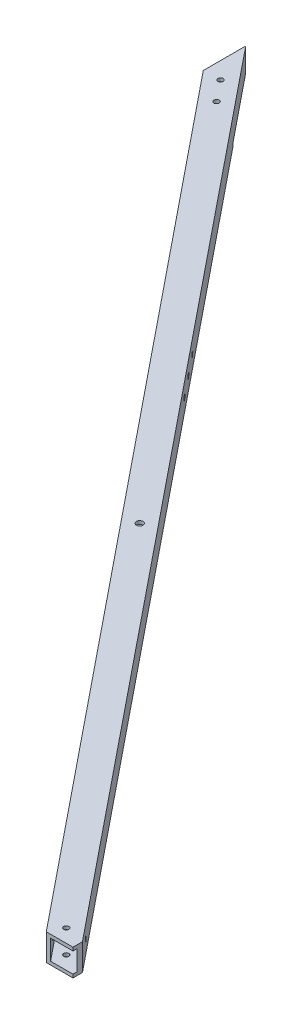
ISO-10303-21;
HEADER;
FILE_DESCRIPTION(('STEP AP214'),'2;1');
FILE_NAME('part.step','',(''),(''),'','','');
FILE_SCHEMA(('AUTOMOTIVE_DESIGN { 1 0 10303 214 1 1 1 1 }'));
ENDSEC;
DATA;
#1=APPLICATION_CONTEXT('core data for automotive mechanical design processes');
#2=APPLICATION_PROTOCOL_DEFINITION('international standard','automotive_design',2000,#1);
#3=PRODUCT_CONTEXT('',#1,'mechanical');
#4=PRODUCT('Part','Part','',(#3));
#5=PRODUCT_RELATED_PRODUCT_CATEGORY('part','',(#4));
#6=PRODUCT_DEFINITION_FORMATION('','',#4);
#7=PRODUCT_DEFINITION_CONTEXT('part definition',#1,'design');
#8=PRODUCT_DEFINITION('design','',#6,#7);
#9=PRODUCT_DEFINITION_SHAPE('','',#8);
#10=(LENGTH_UNIT() NAMED_UNIT(*) SI_UNIT(.MILLI.,.METRE.));
#11=(NAMED_UNIT(*) PLANE_ANGLE_UNIT() SI_UNIT($,.RADIAN.));
#12=(NAMED_UNIT(*) SI_UNIT($,.STERADIAN.) SOLID_ANGLE_UNIT());
#13=UNCERTAINTY_MEASURE_WITH_UNIT(LENGTH_MEASURE(1.E-05),#10,'distance_accuracy_value','');
#14=(GEOMETRIC_REPRESENTATION_CONTEXT(3) GLOBAL_UNCERTAINTY_ASSIGNED_CONTEXT((#13)) GLOBAL_UNIT_ASSIGNED_CONTEXT((#10,
#11,#12)) REPRESENTATION_CONTEXT('',''));
#15=CARTESIAN_POINT('',(0.,0.,0.));
#16=DIRECTION('',(0.,0.,1.));
#17=DIRECTION('',(1.,0.,0.));
#18=AXIS2_PLACEMENT_3D('',#15,#16,#17);
#19=CARTESIAN_POINT('',(-634.999999999998,25.4,1.74641501570018E-12));
#20=DIRECTION('',(-1.,0.,0.));
#21=DIRECTION('',(0.,0.,1.));
#22=AXIS2_PLACEMENT_3D('',#19,#20,#21);
#23=PLANE('',#22);
#24=DIRECTION('',(0.,-1.,0.));
#25=VECTOR('',#24,1.);
#26=CARTESIAN_POINT('',(-635.,25.4,-824.750614635277));
#27=LINE('',#26,#25);
#28=CARTESIAN_POINT('',(-635.,25.4,-824.750614635277));
#29=VERTEX_POINT('',#28);
#30=CARTESIAN_POINT('',(-635.,3.175,-824.750614635277));
#31=VERTEX_POINT('',#30);
#32=EDGE_CURVE('E159',#29,#31,#27,.T.);
#33=ORIENTED_EDGE('',*,*,#32,.T.);
#34=DIRECTION('',(0.,0.,-1.));
#35=VECTOR('',#34,1.);
#36=CARTESIAN_POINT('',(-635.,3.175,-784.38268294097));
#37=LINE('',#36,#35);
#38=CARTESIAN_POINT('',(-635.,3.175,-819.704623173489));
#39=VERTEX_POINT('',#38);
#40=EDGE_CURVE('E142',#39,#31,#37,.T.);
#41=ORIENTED_EDGE('',*,*,#40,.F.);
#42=DIRECTION('',(0.,-1.,0.));
#43=VECTOR('',#42,1.);
#44=CARTESIAN_POINT('',(-635.,25.4000000000001,-819.704623173489));
#45=LINE('',#44,#43);
#46=CARTESIAN_POINT('',(-635.,22.225,-819.704623173489));
#47=VERTEX_POINT('',#46);
#48=EDGE_CURVE('E292',#47,#39,#45,.T.);
#49=ORIENTED_EDGE('',*,*,#48,.F.);
#50=DIRECTION('',(0.,0.,-1.));
#51=VECTOR('',#50,1.);
#52=CARTESIAN_POINT('',(-634.999999999998,22.2249999999999,1.74605117923857E-12));
#53=LINE('',#52,#51);
#54=CARTESIAN_POINT('',(-635.,22.225,-789.428674402759));
#55=VERTEX_POINT('',#54);
#56=EDGE_CURVE('E282',#55,#47,#53,.T.);
#57=ORIENTED_EDGE('',*,*,#56,.F.);
#58=DIRECTION('',(0.,1.,0.));
#59=VECTOR('',#58,1.);
#60=CARTESIAN_POINT('',(-635.,25.4,-789.428674402759));
#61=LINE('',#60,#59);
#62=CARTESIAN_POINT('',(-635.,3.175,-789.428674402759));
#63=VERTEX_POINT('',#62);
#64=EDGE_CURVE('E152',#63,#55,#61,.T.);
#65=ORIENTED_EDGE('',*,*,#64,.F.);
#66=CARTESIAN_POINT('',(-635.,3.175,-784.38268294097));
#67=VERTEX_POINT('',#66);
#68=EDGE_CURVE('E134',#67,#63,#37,.T.);
#69=ORIENTED_EDGE('',*,*,#68,.F.);
#70=DIRECTION('',(0.,-1.,0.));
#71=VECTOR('',#70,1.);
#72=CARTESIAN_POINT('',(-635.,25.4,-784.38268294097));
#73=LINE('',#72,#71);
#74=CARTESIAN_POINT('',(-635.,25.4,-784.38268294097));
#75=VERTEX_POINT('',#74);
#76=EDGE_CURVE('E149',#75,#67,#73,.T.);
#77=ORIENTED_EDGE('',*,*,#76,.F.);
#78=DIRECTION('',(0.,0.,-1.));
#79=VECTOR('',#78,1.);
#80=CARTESIAN_POINT('',(-634.999999999998,25.4,1.74641501570018E-12));
#81=LINE('',#80,#79);
#82=EDGE_CURVE('E298',#75,#29,#81,.T.);
#83=ORIENTED_EDGE('',*,*,#82,.T.);
#84=EDGE_LOOP('',(#33,#41,#49,#57,#65,#69,#77,#83));
#85=FACE_BOUND('',#84,.T.);
#86=ADVANCED_FACE('F36',(#85),#23,.T.);
#87=CARTESIAN_POINT('',(19.7417299430379,25.4,-15.9819929563291));
#88=DIRECTION('',(-0.777233462324333,0.,0.629212321115321));
#89=DIRECTION('',(0.629212321115321,0.,0.777233462324333));
#90=AXIS2_PLACEMENT_3D('',#87,#88,#89);
#91=PLANE('',#90);
#92=CARTESIAN_POINT('',(-403.261102133227,12.6999999999971,-538.495530461226));
#93=DIRECTION('',(0.777233462324332,0.,-0.629212321115321));
#94=DIRECTION('',(-0.629212321115322,0.,-0.777233462324333));
#95=AXIS2_PLACEMENT_3D('',#92,#93,#94);
#96=CIRCLE('',#95,2.48919999999994);
#97=CARTESIAN_POINT('',(-404.827337442947,12.6999999999971,-540.430219995643));
#98=VERTEX_POINT('',#97);
#99=EDGE_CURVE('E665',#98,#98,#96,.T.);
#100=ORIENTED_EDGE('',*,*,#99,.F.);
#101=EDGE_LOOP('',(#100));
#102=FACE_BOUND('',#101,.T.);
#103=CARTESIAN_POINT('',(-419.243095089556,12.6999999999971,-558.237260404264));
#104=DIRECTION('',(0.777233462324332,0.,-0.629212321115321));
#105=DIRECTION('',(-0.629212321115322,0.,-0.777233462324333));
#106=AXIS2_PLACEMENT_3D('',#103,#104,#105);
#107=CIRCLE('',#106,2.48919999999997);
#108=CARTESIAN_POINT('',(-420.809330399276,12.6999999999971,-560.171949938681));
#109=VERTEX_POINT('',#108);
#110=EDGE_CURVE('E656',#109,#109,#107,.T.);
#111=ORIENTED_EDGE('',*,*,#110,.F.);
#112=EDGE_LOOP('',(#111));
#113=FACE_BOUND('',#112,.T.);
#114=CARTESIAN_POINT('',(-387.279109176898,12.6999999999971,-518.753800518188));
#115=DIRECTION('',(0.777233462324332,0.,-0.629212321115321));
#116=DIRECTION('',(-0.629212321115322,0.,-0.777233462324333));
#117=AXIS2_PLACEMENT_3D('',#114,#115,#116);
#118=CIRCLE('',#117,2.48919999999997);
#119=CARTESIAN_POINT('',(-388.845344486618,12.6999999999971,-520.688490052605));
#120=VERTEX_POINT('',#119);
#121=EDGE_CURVE('E201',#120,#120,#118,.T.);
#122=ORIENTED_EDGE('',*,*,#121,.F.);
#123=EDGE_LOOP('',(#122));
#124=FACE_BOUND('',#123,.T.);
#125=CARTESIAN_POINT('',(11.7507334648733,12.7,-25.8528579278481));
#126=DIRECTION('',(-0.777233462324333,0.,0.629212321115321));
#127=DIRECTION('',(0.629212321115321,0.,0.777233462324333));
#128=AXIS2_PLACEMENT_3D('',#125,#126,#127);
#129=CIRCLE('',#128,2.48919999999999);
#130=CARTESIAN_POINT('',(13.3169687745936,12.7,-23.9181683934304));
#131=VERTEX_POINT('',#130);
#132=EDGE_CURVE('E253',#131,#131,#129,.T.);
#133=ORIENTED_EDGE('',*,*,#132,.T.);
#134=EDGE_LOOP('',(#133));
#135=FACE_BOUND('',#134,.T.);
#136=DIRECTION('',(-0.629212321115321,0.,-0.777233462324333));
#137=VECTOR('',#136,1.);
#138=CARTESIAN_POINT('',(19.7417299430379,0.,-15.9819929563291));
#139=LINE('',#138,#137);
#140=CARTESIAN_POINT('',(25.4,0.,-8.99262437666851));
#141=VERTEX_POINT('',#140);
#142=CARTESIAN_POINT('',(-584.2,0.,-762.));
#143=VERTEX_POINT('',#142);
#144=EDGE_CURVE('E295',#141,#143,#139,.T.);
#145=ORIENTED_EDGE('',*,*,#144,.T.);
#146=DIRECTION('',(0.,-1.,0.));
#147=VECTOR('',#146,1.);
#148=CARTESIAN_POINT('',(-584.2,3.175,-762.));
#149=LINE('',#148,#147);
#150=CARTESIAN_POINT('',(-584.2,3.175,-762.));
#151=VERTEX_POINT('',#150);
#152=EDGE_CURVE('E236',#151,#143,#149,.T.);
#153=ORIENTED_EDGE('',*,*,#152,.F.);
#154=DIRECTION('',(0.629212321115321,0.,0.777233462324333));
#155=VECTOR('',#154,1.);
#156=CARTESIAN_POINT('',(-635.,3.175,-824.750614635277));
#157=LINE('',#156,#155);
#158=EDGE_CURVE('E153',#31,#151,#157,.T.);
#159=ORIENTED_EDGE('',*,*,#158,.F.);
#160=ORIENTED_EDGE('',*,*,#32,.F.);
#161=DIRECTION('',(-0.629212321115321,0.,-0.777233462324333));
#162=VECTOR('',#161,1.);
#163=CARTESIAN_POINT('',(19.7417299430379,25.4,-15.9819929563291));
#164=LINE('',#163,#162);
#165=CARTESIAN_POINT('',(25.4,25.4,-8.99262437666851));
#166=VERTEX_POINT('',#165);
#167=EDGE_CURVE('E296',#166,#29,#164,.T.);
#168=ORIENTED_EDGE('',*,*,#167,.F.);
#169=DIRECTION('',(0.,1.,0.));
#170=VECTOR('',#169,1.);
#171=CARTESIAN_POINT('',(25.4,0.,-8.99262437666851));
#172=LINE('',#171,#170);
#173=EDGE_CURVE('E268',#141,#166,#172,.T.);
#174=ORIENTED_EDGE('',*,*,#173,.F.);
#175=EDGE_LOOP('',(#145,#153,#159,#160,#168,#174));
#176=FACE_BOUND('',#175,.T.);
#177=ADVANCED_FACE('F38',(#102,#113,#124,#135,#176),#91,.F.);
#178=CARTESIAN_POINT('',(0.,25.4,0.));
#179=DIRECTION('',(0.,0.,-1.));
#180=DIRECTION('',(-1.,0.,0.));
#181=AXIS2_PLACEMENT_3D('',#178,#179,#180);
#182=PLANE('',#181);
#183=DIRECTION('',(0.,1.,0.));
#184=VECTOR('',#183,1.);
#185=CARTESIAN_POINT('',(25.4,0.,0.));
#186=LINE('',#185,#184);
#187=CARTESIAN_POINT('',(25.4,22.225,0.));
#188=VERTEX_POINT('',#187);
#189=CARTESIAN_POINT('',(25.4,25.4,0.));
#190=VERTEX_POINT('',#189);
#191=EDGE_CURVE('E52',#188,#190,#186,.T.);
#192=ORIENTED_EDGE('',*,*,#191,.T.);
#193=DIRECTION('',(1.,0.,0.));
#194=VECTOR('',#193,1.);
#195=CARTESIAN_POINT('',(0.,25.4,0.));
#196=LINE('',#195,#194);
#197=CARTESIAN_POINT('',(0.,25.4,0.));
#198=VERTEX_POINT('',#197);
#199=EDGE_CURVE('E165',#198,#190,#196,.T.);
#200=ORIENTED_EDGE('',*,*,#199,.F.);
#201=DIRECTION('',(0.,-1.,0.));
#202=VECTOR('',#201,1.);
#203=CARTESIAN_POINT('',(0.,25.4,0.));
#204=LINE('',#203,#202);
#205=CARTESIAN_POINT('',(0.,0.,0.));
#206=VERTEX_POINT('',#205);
#207=EDGE_CURVE('E160',#198,#206,#204,.T.);
#208=ORIENTED_EDGE('',*,*,#207,.T.);
#209=DIRECTION('',(1.,0.,0.));
#210=VECTOR('',#209,1.);
#211=CARTESIAN_POINT('',(0.,0.,0.));
#212=LINE('',#211,#210);
#213=CARTESIAN_POINT('',(25.4,0.,0.));
#214=VERTEX_POINT('',#213);
#215=EDGE_CURVE('E299',#206,#214,#212,.T.);
#216=ORIENTED_EDGE('',*,*,#215,.T.);
#217=CARTESIAN_POINT('',(25.4,3.175,0.));
#218=VERTEX_POINT('',#217);
#219=EDGE_CURVE('E271',#214,#218,#186,.T.);
#220=ORIENTED_EDGE('',*,*,#219,.T.);
#221=DIRECTION('',(-1.,0.,0.));
#222=VECTOR('',#221,1.);
#223=CARTESIAN_POINT('',(0.,3.175,0.));
#224=LINE('',#223,#222);
#225=CARTESIAN_POINT('',(4.08500168084003,3.175,1.11022302462516E-13));
#226=VERTEX_POINT('',#225);
#227=EDGE_CURVE('E45',#218,#226,#224,.T.);
#228=ORIENTED_EDGE('',*,*,#227,.T.);
#229=DIRECTION('',(0.,1.,0.));
#230=VECTOR('',#229,1.);
#231=CARTESIAN_POINT('',(4.08500168084006,25.4,0.));
#232=LINE('',#231,#230);
#233=CARTESIAN_POINT('',(4.08500168083992,22.225,0.));
#234=VERTEX_POINT('',#233);
#235=EDGE_CURVE('E171',#226,#234,#232,.T.);
#236=ORIENTED_EDGE('',*,*,#235,.T.);
#237=DIRECTION('',(1.,0.,0.));
#238=VECTOR('',#237,1.);
#239=CARTESIAN_POINT('',(0.,22.225,0.));
#240=LINE('',#239,#238);
#241=EDGE_CURVE('E162',#234,#188,#240,.T.);
#242=ORIENTED_EDGE('',*,*,#241,.T.);
#243=EDGE_LOOP('',(#192,#200,#208,#216,#220,#228,#236,#242));
#244=FACE_BOUND('',#243,.T.);
#245=ADVANCED_FACE('F310',(#244),#182,.F.);
#246=CARTESIAN_POINT('',(0.,25.4,0.));
#247=DIRECTION('',(0.,1.,0.));
#248=DIRECTION('',(0.,0.,1.));
#249=AXIS2_PLACEMENT_3D('',#246,#247,#248);
#250=PLANE('',#249);
#251=CARTESIAN_POINT('',(-603.036014087342,25.4000000000001,-765.083188902048));
#252=DIRECTION('',(0.,-1.,0.));
#253=DIRECTION('',(1.,0.,0.));
#254=AXIS2_PLACEMENT_3D('',#251,#252,#253);
#255=CIRCLE('',#254,2.48919999999994);
#256=CARTESIAN_POINT('',(-600.546814087342,25.4000000000001,-765.083188902048));
#257=VERTEX_POINT('',#256);
#258=EDGE_CURVE('E195',#257,#257,#255,.T.);
#259=ORIENTED_EDGE('',*,*,#258,.T.);
#260=EDGE_LOOP('',(#259));
#261=FACE_BOUND('',#260,.T.);
#262=CARTESIAN_POINT('',(-619.018007043671,25.4000000000001,-784.824918845086));
#263=DIRECTION('',(0.,-1.,0.));
#264=DIRECTION('',(1.,0.,0.));
#265=AXIS2_PLACEMENT_3D('',#262,#263,#264);
#266=CIRCLE('',#265,2.48919999999994);
#267=CARTESIAN_POINT('',(-616.528807043671,25.4000000000001,-784.824918845086));
#268=VERTEX_POINT('',#267);
#269=EDGE_CURVE('E227',#268,#268,#266,.T.);
#270=ORIENTED_EDGE('',*,*,#269,.T.);
#271=EDGE_LOOP('',(#270));
#272=FACE_BOUND('',#271,.T.);
#273=CARTESIAN_POINT('',(-292.1,25.4,-381.));
#274=DIRECTION('',(0.,1.,0.));
#275=DIRECTION('',(0.,0.,1.));
#276=AXIS2_PLACEMENT_3D('',#273,#274,#275);
#277=CIRCLE('',#276,3.17499999999997);
#278=CARTESIAN_POINT('',(-292.1,25.4,-377.825));
#279=VERTEX_POINT('',#278);
#280=EDGE_CURVE('E241',#279,#279,#277,.T.);
#281=ORIENTED_EDGE('',*,*,#280,.F.);
#282=EDGE_LOOP('',(#281));
#283=FACE_BOUND('',#282,.T.);
#284=CARTESIAN_POINT('',(6.34999999999977,25.4,-12.7));
#285=DIRECTION('',(0.,-1.,0.));
#286=DIRECTION('',(0.,0.,-1.));
#287=AXIS2_PLACEMENT_3D('',#284,#285,#286);
#288=CIRCLE('',#287,2.48919999999999);
#289=CARTESIAN_POINT('',(6.34999999999977,25.4,-15.1891999999999));
#290=VERTEX_POINT('',#289);
#291=EDGE_CURVE('E180',#290,#290,#288,.T.);
#292=ORIENTED_EDGE('',*,*,#291,.T.);
#293=EDGE_LOOP('',(#292));
#294=FACE_BOUND('',#293,.T.);
#295=ORIENTED_EDGE('',*,*,#199,.T.);
#296=DIRECTION('',(0.,0.,-1.));
#297=VECTOR('',#296,1.);
#298=CARTESIAN_POINT('',(25.4,25.4,0.));
#299=LINE('',#298,#297);
#300=EDGE_CURVE('E263',#190,#166,#299,.T.);
#301=ORIENTED_EDGE('',*,*,#300,.T.);
#302=ORIENTED_EDGE('',*,*,#167,.T.);
#303=ORIENTED_EDGE('',*,*,#82,.F.);
#304=DIRECTION('',(0.629212321115321,0.,0.777233462324333));
#305=VECTOR('',#304,1.);
#306=CARTESIAN_POINT('',(0.,25.4,0.));
#307=LINE('',#306,#305);
#308=EDGE_CURVE('E157',#75,#198,#307,.T.);
#309=ORIENTED_EDGE('',*,*,#308,.T.);
#310=EDGE_LOOP('',(#295,#301,#302,#303,#309));
#311=FACE_BOUND('',#310,.T.);
#312=ADVANCED_FACE('F327',(#261,#272,#283,#294,#311),#250,.T.);
#313=CARTESIAN_POINT('',(0.,0.,0.));
#314=DIRECTION('',(0.,1.,0.));
#315=DIRECTION('',(0.,0.,1.));
#316=AXIS2_PLACEMENT_3D('',#313,#314,#315);
#317=PLANE('',#316);
#318=CARTESIAN_POINT('',(-292.1,0.,-381.));
#319=DIRECTION('',(0.,1.,0.));
#320=DIRECTION('',(0.,0.,1.));
#321=AXIS2_PLACEMENT_3D('',#318,#319,#320);
#322=CIRCLE('',#321,3.17499999999997);
#323=CARTESIAN_POINT('',(-292.1,0.,-377.825));
#324=VERTEX_POINT('',#323);
#325=EDGE_CURVE('E190',#324,#324,#322,.T.);
#326=ORIENTED_EDGE('',*,*,#325,.T.);
#327=EDGE_LOOP('',(#326));
#328=FACE_BOUND('',#327,.T.);
#329=CARTESIAN_POINT('',(6.34999999999977,0.,-12.7));
#330=DIRECTION('',(0.,-1.,0.));
#331=DIRECTION('',(0.,0.,-1.));
#332=AXIS2_PLACEMENT_3D('',#329,#330,#331);
#333=CIRCLE('',#332,2.48919999999999);
#334=CARTESIAN_POINT('',(6.34999999999977,0.,-15.1891999999999));
#335=VERTEX_POINT('',#334);
#336=EDGE_CURVE('E256',#335,#335,#333,.T.);
#337=ORIENTED_EDGE('',*,*,#336,.F.);
#338=EDGE_LOOP('',(#337));
#339=FACE_BOUND('',#338,.T.);
#340=DIRECTION('',(0.629212321115321,0.,0.777233462324333));
#341=VECTOR('',#340,1.);
#342=CARTESIAN_POINT('',(0.,0.,0.));
#343=LINE('',#342,#341);
#344=CARTESIAN_POINT('',(-584.2,0.,-721.632068305693));
#345=VERTEX_POINT('',#344);
#346=EDGE_CURVE('E306',#345,#206,#343,.T.);
#347=ORIENTED_EDGE('',*,*,#346,.F.);
#348=DIRECTION('',(0.,0.,1.));
#349=VECTOR('',#348,1.);
#350=CARTESIAN_POINT('',(-584.2,0.,-762.));
#351=LINE('',#350,#349);
#352=EDGE_CURVE('E143',#143,#345,#351,.T.);
#353=ORIENTED_EDGE('',*,*,#352,.F.);
#354=ORIENTED_EDGE('',*,*,#144,.F.);
#355=DIRECTION('',(0.,0.,-1.));
#356=VECTOR('',#355,1.);
#357=CARTESIAN_POINT('',(25.4,0.,0.));
#358=LINE('',#357,#356);
#359=EDGE_CURVE('E264',#214,#141,#358,.T.);
#360=ORIENTED_EDGE('',*,*,#359,.F.);
#361=ORIENTED_EDGE('',*,*,#215,.F.);
#362=EDGE_LOOP('',(#347,#353,#354,#360,#361));
#363=FACE_BOUND('',#362,.T.);
#364=ADVANCED_FACE('F316',(#328,#339,#363),#317,.F.);
#365=CARTESIAN_POINT('',(-637.46771624288,3.175,-822.752865515736));
#366=DIRECTION('',(0.777233462324333,0.,-0.629212321115321));
#367=DIRECTION('',(-0.629212321115321,0.,-0.777233462324333));
#368=AXIS2_PLACEMENT_3D('',#365,#366,#367);
#369=PLANE('',#368);
#370=CARTESIAN_POINT('',(-405.728818376107,12.6999999999971,-536.497781341684));
#371=DIRECTION('',(0.777233462324333,0.,-0.629212321115321));
#372=DIRECTION('',(-0.629212321115321,0.,-0.777233462324333));
#373=AXIS2_PLACEMENT_3D('',#370,#371,#372);
#374=CIRCLE('',#373,2.48919999999994);
#375=CARTESIAN_POINT('',(-407.295053685827,12.6999999999971,-538.432470876102));
#376=VERTEX_POINT('',#375);
#377=EDGE_CURVE('E224',#376,#376,#374,.T.);
#378=ORIENTED_EDGE('',*,*,#377,.T.);
#379=EDGE_LOOP('',(#378));
#380=FACE_BOUND('',#379,.T.);
#381=CARTESIAN_POINT('',(-421.710811332436,12.6999999999971,-556.239511284722));
#382=DIRECTION('',(0.777233462324333,0.,-0.629212321115321));
#383=DIRECTION('',(-0.629212321115321,0.,-0.777233462324333));
#384=AXIS2_PLACEMENT_3D('',#381,#382,#383);
#385=CIRCLE('',#384,2.48919999999997);
#386=CARTESIAN_POINT('',(-423.277046642156,12.6999999999971,-558.17420081914));
#387=VERTEX_POINT('',#386);
#388=EDGE_CURVE('E209',#387,#387,#385,.T.);
#389=ORIENTED_EDGE('',*,*,#388,.T.);
#390=EDGE_LOOP('',(#389));
#391=FACE_BOUND('',#390,.T.);
#392=CARTESIAN_POINT('',(-389.746825419777,12.6999999999971,-516.756051398646));
#393=DIRECTION('',(0.777233462324333,0.,-0.629212321115321));
#394=DIRECTION('',(-0.629212321115321,0.,-0.777233462324333));
#395=AXIS2_PLACEMENT_3D('',#392,#393,#394);
#396=CIRCLE('',#395,2.48919999999997);
#397=CARTESIAN_POINT('',(-391.313060729498,12.6999999999971,-518.690740933064));
#398=VERTEX_POINT('',#397);
#399=EDGE_CURVE('E205',#398,#398,#396,.T.);
#400=ORIENTED_EDGE('',*,*,#399,.T.);
#401=EDGE_LOOP('',(#400));
#402=FACE_BOUND('',#401,.T.);
#403=CARTESIAN_POINT('',(9.28301722199354,12.7,-23.8551088083069));
#404=DIRECTION('',(0.777233462324333,0.,-0.629212321115321));
#405=DIRECTION('',(-0.629212321115321,0.,-0.777233462324333));
#406=AXIS2_PLACEMENT_3D('',#403,#404,#405);
#407=CIRCLE('',#406,2.48919999999999);
#408=CARTESIAN_POINT('',(7.71678191227329,12.7,-25.7897983427247));
#409=VERTEX_POINT('',#408);
#410=EDGE_CURVE('E184',#409,#409,#407,.T.);
#411=ORIENTED_EDGE('',*,*,#410,.T.);
#412=EDGE_LOOP('',(#411));
#413=FACE_BOUND('',#412,.T.);
#414=DIRECTION('',(0.,-1.,0.));
#415=VECTOR('',#414,1.);
#416=CARTESIAN_POINT('',(25.4000000000001,3.17499999999985,-3.94663291487984));
#417=LINE('',#416,#415);
#418=CARTESIAN_POINT('',(25.3999999999999,22.225,-3.94663291487996));
#419=VERTEX_POINT('',#418);
#420=CARTESIAN_POINT('',(25.4000000000001,3.175,-3.94663291487984));
#421=VERTEX_POINT('',#420);
#422=EDGE_CURVE('E270',#419,#421,#417,.T.);
#423=ORIENTED_EDGE('',*,*,#422,.F.);
#424=DIRECTION('',(0.629212321115321,0.,0.777233462324333));
#425=VECTOR('',#424,1.);
#426=CARTESIAN_POINT('',(-637.46771624288,22.225,-822.752865515736));
#427=LINE('',#426,#425);
#428=EDGE_CURVE('E278',#47,#419,#427,.T.);
#429=ORIENTED_EDGE('',*,*,#428,.F.);
#430=ORIENTED_EDGE('',*,*,#48,.T.);
#431=DIRECTION('',(0.629212321115321,0.,0.777233462324333));
#432=VECTOR('',#431,1.);
#433=CARTESIAN_POINT('',(-637.46771624288,3.175,-822.752865515736));
#434=LINE('',#433,#432);
#435=CARTESIAN_POINT('',(-584.2,3.175,-756.954008538211));
#436=VERTEX_POINT('',#435);
#437=EDGE_CURVE('E279',#39,#436,#434,.T.);
#438=ORIENTED_EDGE('',*,*,#437,.T.);
#439=EDGE_CURVE('E283',#436,#421,#434,.T.);
#440=ORIENTED_EDGE('',*,*,#439,.T.);
#441=EDGE_LOOP('',(#423,#429,#430,#438,#440));
#442=FACE_BOUND('',#441,.T.);
#443=ADVANCED_FACE('F338',(#380,#391,#402,#413,#442),#369,.F.);
#444=CARTESIAN_POINT('',(-652.274013700158,3.175,-810.76637079849));
#445=DIRECTION('',(0.,-1.,0.));
#446=DIRECTION('',(0.,0.,-1.));
#447=AXIS2_PLACEMENT_3D('',#444,#445,#446);
#448=PLANE('',#447);
#449=CARTESIAN_POINT('',(-292.1,3.175,-381.));
#450=DIRECTION('',(0.,-1.,0.));
#451=DIRECTION('',(0.,0.,-1.));
#452=AXIS2_PLACEMENT_3D('',#449,#450,#451);
#453=CIRCLE('',#452,3.17499999999997);
#454=CARTESIAN_POINT('',(-292.1,3.175,-384.175));
#455=VERTEX_POINT('',#454);
#456=EDGE_CURVE('E189',#455,#455,#453,.T.);
#457=ORIENTED_EDGE('',*,*,#456,.T.);
#458=EDGE_LOOP('',(#457));
#459=FACE_BOUND('',#458,.T.);
#460=CARTESIAN_POINT('',(6.34999999999977,3.175,-12.7));
#461=DIRECTION('',(0.,-1.,0.));
#462=DIRECTION('',(0.,0.,-1.));
#463=AXIS2_PLACEMENT_3D('',#460,#461,#462);
#464=CIRCLE('',#463,2.48919999999999);
#465=CARTESIAN_POINT('',(6.34999999999977,3.175,-15.1891999999999));
#466=VERTEX_POINT('',#465);
#467=EDGE_CURVE('E179',#466,#466,#464,.T.);
#468=ORIENTED_EDGE('',*,*,#467,.T.);
#469=EDGE_LOOP('',(#468));
#470=FACE_BOUND('',#469,.T.);
#471=ORIENTED_EDGE('',*,*,#439,.F.);
#472=DIRECTION('',(0.,0.,1.));
#473=VECTOR('',#472,1.);
#474=CARTESIAN_POINT('',(-584.2,3.175,-762.));
#475=LINE('',#474,#473);
#476=CARTESIAN_POINT('',(-584.2,3.175,-726.678059767481));
#477=VERTEX_POINT('',#476);
#478=EDGE_CURVE('E237',#436,#477,#475,.T.);
#479=ORIENTED_EDGE('',*,*,#478,.T.);
#480=DIRECTION('',(0.629212321115321,0.,0.777233462324333));
#481=VECTOR('',#480,1.);
#482=CARTESIAN_POINT('',(-652.274013700158,3.175,-810.76637079849));
#483=LINE('',#482,#481);
#484=EDGE_CURVE('E286',#477,#226,#483,.T.);
#485=ORIENTED_EDGE('',*,*,#484,.T.);
#486=ORIENTED_EDGE('',*,*,#227,.F.);
#487=DIRECTION('',(0.,0.,1.));
#488=VECTOR('',#487,1.);
#489=CARTESIAN_POINT('',(25.4,3.175,-810.76637079849));
#490=LINE('',#489,#488);
#491=EDGE_CURVE('E276',#421,#218,#490,.T.);
#492=ORIENTED_EDGE('',*,*,#491,.F.);
#493=EDGE_LOOP('',(#471,#479,#485,#486,#492));
#494=FACE_BOUND('',#493,.T.);
#495=ADVANCED_FACE('F342',(#459,#470,#494),#448,.F.);
#496=CARTESIAN_POINT('',(-637.46771624288,22.225,-822.752865515736));
#497=DIRECTION('',(0.,1.,0.));
#498=DIRECTION('',(-1.,0.,0.));
#499=AXIS2_PLACEMENT_3D('',#496,#497,#498);
#500=PLANE('',#499);
#501=CARTESIAN_POINT('',(-603.036014087342,22.225,-765.083188902048));
#502=DIRECTION('',(0.,1.,0.));
#503=DIRECTION('',(-1.,0.,0.));
#504=AXIS2_PLACEMENT_3D('',#501,#502,#503);
#505=CIRCLE('',#504,2.48919999999994);
#506=CARTESIAN_POINT('',(-605.525214087342,22.225,-765.083188902048));
#507=VERTEX_POINT('',#506);
#508=EDGE_CURVE('E194',#507,#507,#505,.T.);
#509=ORIENTED_EDGE('',*,*,#508,.T.);
#510=EDGE_LOOP('',(#509));
#511=FACE_BOUND('',#510,.T.);
#512=CARTESIAN_POINT('',(-619.018007043671,22.225,-784.824918845086));
#513=DIRECTION('',(0.,1.,0.));
#514=DIRECTION('',(-1.,0.,0.));
#515=AXIS2_PLACEMENT_3D('',#512,#513,#514);
#516=CIRCLE('',#515,2.48919999999994);
#517=CARTESIAN_POINT('',(-621.507207043671,22.225,-784.824918845086));
#518=VERTEX_POINT('',#517);
#519=EDGE_CURVE('E191',#518,#518,#516,.T.);
#520=ORIENTED_EDGE('',*,*,#519,.T.);
#521=EDGE_LOOP('',(#520));
#522=FACE_BOUND('',#521,.T.);
#523=CARTESIAN_POINT('',(-292.1,22.225,-381.));
#524=DIRECTION('',(0.,1.,0.));
#525=DIRECTION('',(-1.,0.,0.));
#526=AXIS2_PLACEMENT_3D('',#523,#524,#525);
#527=CIRCLE('',#526,3.17499999999997);
#528=CARTESIAN_POINT('',(-295.275,22.225,-381.));
#529=VERTEX_POINT('',#528);
#530=EDGE_CURVE('E186',#529,#529,#527,.T.);
#531=ORIENTED_EDGE('',*,*,#530,.T.);
#532=EDGE_LOOP('',(#531));
#533=FACE_BOUND('',#532,.T.);
#534=CARTESIAN_POINT('',(6.34999999999977,22.225,-12.7));
#535=DIRECTION('',(0.,1.,0.));
#536=DIRECTION('',(-1.,0.,0.));
#537=AXIS2_PLACEMENT_3D('',#534,#535,#536);
#538=CIRCLE('',#537,2.48919999999999);
#539=CARTESIAN_POINT('',(3.86079999999978,22.225,-12.7));
#540=VERTEX_POINT('',#539);
#541=EDGE_CURVE('E176',#540,#540,#538,.T.);
#542=ORIENTED_EDGE('',*,*,#541,.T.);
#543=EDGE_LOOP('',(#542));
#544=FACE_BOUND('',#543,.T.);
#545=DIRECTION('',(0.,0.,-1.));
#546=VECTOR('',#545,1.);
#547=CARTESIAN_POINT('',(25.4,22.2250000000001,-822.752865515736));
#548=LINE('',#547,#546);
#549=EDGE_CURVE('E11',#188,#419,#548,.T.);
#550=ORIENTED_EDGE('',*,*,#549,.F.);
#551=ORIENTED_EDGE('',*,*,#241,.F.);
#552=DIRECTION('',(0.629212321115321,0.,0.777233462324333));
#553=VECTOR('',#552,1.);
#554=CARTESIAN_POINT('',(-652.274013700158,22.225,-810.76637079849));
#555=LINE('',#554,#553);
#556=EDGE_CURVE('E60',#55,#234,#555,.T.);
#557=ORIENTED_EDGE('',*,*,#556,.F.);
#558=ORIENTED_EDGE('',*,*,#56,.T.);
#559=ORIENTED_EDGE('',*,*,#428,.T.);
#560=EDGE_LOOP('',(#550,#551,#557,#558,#559));
#561=FACE_BOUND('',#560,.T.);
#562=ADVANCED_FACE('F329',(#511,#522,#533,#544,#561),#500,.F.);
#563=CARTESIAN_POINT('',(0.,25.4,0.));
#564=DIRECTION('',(0.777233462324333,0.,-0.629212321115321));
#565=DIRECTION('',(-0.629212321115321,0.,-0.777233462324333));
#566=AXIS2_PLACEMENT_3D('',#563,#564,#565);
#567=PLANE('',#566);
#568=CARTESIAN_POINT('',(-423.002832076265,12.6999999999971,-522.513537504896));
#569=DIRECTION('',(0.777233462324333,0.,-0.629212321115321));
#570=DIRECTION('',(-0.629212321115321,0.,-0.777233462324333));
#571=AXIS2_PLACEMENT_3D('',#568,#569,#570);
#572=CIRCLE('',#571,2.48919999999994);
#573=CARTESIAN_POINT('',(-424.569067385985,12.6999999999971,-524.448227039314));
#574=VERTEX_POINT('',#573);
#575=EDGE_CURVE('E221',#574,#574,#572,.T.);
#576=ORIENTED_EDGE('',*,*,#575,.T.);
#577=EDGE_LOOP('',(#576));
#578=FACE_BOUND('',#577,.T.);
#579=CARTESIAN_POINT('',(-438.984825032594,12.6999999999971,-542.255267447935));
#580=DIRECTION('',(0.777233462324333,0.,-0.629212321115321));
#581=DIRECTION('',(-0.629212321115321,0.,-0.777233462324333));
#582=AXIS2_PLACEMENT_3D('',#579,#580,#581);
#583=CIRCLE('',#582,2.48919999999997);
#584=CARTESIAN_POINT('',(-440.551060342314,12.6999999999971,-544.189956982352));
#585=VERTEX_POINT('',#584);
#586=EDGE_CURVE('E204',#585,#585,#583,.T.);
#587=ORIENTED_EDGE('',*,*,#586,.T.);
#588=EDGE_LOOP('',(#587));
#589=FACE_BOUND('',#588,.T.);
#590=CARTESIAN_POINT('',(-407.020839119936,12.6999999999971,-502.771807561858));
#591=DIRECTION('',(0.777233462324333,0.,-0.629212321115321));
#592=DIRECTION('',(-0.629212321115321,0.,-0.777233462324333));
#593=AXIS2_PLACEMENT_3D('',#590,#591,#592);
#594=CIRCLE('',#593,2.48919999999997);
#595=CARTESIAN_POINT('',(-408.587074429656,12.6999999999971,-504.706497096276));
#596=VERTEX_POINT('',#595);
#597=EDGE_CURVE('E200',#596,#596,#594,.T.);
#598=ORIENTED_EDGE('',*,*,#597,.T.);
#599=EDGE_LOOP('',(#598));
#600=FACE_BOUND('',#599,.T.);
#601=CARTESIAN_POINT('',(-7.99099647816459,12.7,-9.87086497151904));
#602=DIRECTION('',(-0.777233462324333,0.,0.629212321115321));
#603=DIRECTION('',(0.629212321115321,0.,0.777233462324333));
#604=AXIS2_PLACEMENT_3D('',#601,#602,#603);
#605=CIRCLE('',#604,2.48919999999999);
#606=CARTESIAN_POINT('',(-6.42476116844434,12.7,-7.93617543710132));
#607=VERTEX_POINT('',#606);
#608=EDGE_CURVE('E185',#607,#607,#605,.T.);
#609=ORIENTED_EDGE('',*,*,#608,.F.);
#610=EDGE_LOOP('',(#609));
#611=FACE_BOUND('',#610,.T.);
#612=DIRECTION('',(-0.629212321115322,0.,-0.777233462324332));
#613=VECTOR('',#612,1.);
#614=CARTESIAN_POINT('',(-584.2,3.175,-721.632068305693));
#615=LINE('',#614,#613);
#616=CARTESIAN_POINT('',(-584.2,3.175,-721.632068305693));
#617=VERTEX_POINT('',#616);
#618=EDGE_CURVE('E131',#617,#67,#615,.T.);
#619=ORIENTED_EDGE('',*,*,#618,.F.);
#620=DIRECTION('',(0.,-1.,0.));
#621=VECTOR('',#620,1.);
#622=CARTESIAN_POINT('',(-584.2,3.175,-721.632068305693));
#623=LINE('',#622,#621);
#624=EDGE_CURVE('E239',#617,#345,#623,.T.);
#625=ORIENTED_EDGE('',*,*,#624,.T.);
#626=ORIENTED_EDGE('',*,*,#346,.T.);
#627=ORIENTED_EDGE('',*,*,#207,.F.);
#628=ORIENTED_EDGE('',*,*,#308,.F.);
#629=ORIENTED_EDGE('',*,*,#76,.T.);
#630=EDGE_LOOP('',(#619,#625,#626,#627,#628,#629));
#631=FACE_BOUND('',#630,.T.);
#632=ADVANCED_FACE('F155',(#578,#589,#600,#611,#631),#567,.F.);
#633=CARTESIAN_POINT('',(-652.274013700158,22.225,-810.76637079849));
#634=DIRECTION('',(-0.777233462324333,0.,0.629212321115321));
#635=DIRECTION('',(0.629212321115321,0.,0.777233462324333));
#636=AXIS2_PLACEMENT_3D('',#633,#634,#635);
#637=PLANE('',#636);
#638=CARTESIAN_POINT('',(-420.535115833385,12.6999999999971,-524.511286624438));
#639=DIRECTION('',(-0.777233462324333,0.,0.629212321115321));
#640=DIRECTION('',(0.629212321115321,0.,0.777233462324333));
#641=AXIS2_PLACEMENT_3D('',#638,#639,#640);
#642=CIRCLE('',#641,2.48919999999994);
#643=CARTESIAN_POINT('',(-418.968880523665,12.6999999999971,-522.57659709002));
#644=VERTEX_POINT('',#643);
#645=EDGE_CURVE('E40',#644,#644,#642,.T.);
#646=ORIENTED_EDGE('',*,*,#645,.T.);
#647=EDGE_LOOP('',(#646));
#648=FACE_BOUND('',#647,.T.);
#649=CARTESIAN_POINT('',(-436.517108789714,12.6999999999971,-544.253016567476));
#650=DIRECTION('',(-0.777233462324333,0.,0.629212321115321));
#651=DIRECTION('',(0.629212321115321,0.,0.777233462324333));
#652=AXIS2_PLACEMENT_3D('',#649,#650,#651);
#653=CIRCLE('',#652,2.48919999999997);
#654=CARTESIAN_POINT('',(-434.950873479994,12.6999999999971,-542.318327033058));
#655=VERTEX_POINT('',#654);
#656=EDGE_CURVE('E202',#655,#655,#653,.T.);
#657=ORIENTED_EDGE('',*,*,#656,.T.);
#658=EDGE_LOOP('',(#657));
#659=FACE_BOUND('',#658,.T.);
#660=CARTESIAN_POINT('',(-404.553122877056,12.6999999999971,-504.7695566814));
#661=DIRECTION('',(-0.777233462324333,0.,0.629212321115321));
#662=DIRECTION('',(0.629212321115321,0.,0.777233462324333));
#663=AXIS2_PLACEMENT_3D('',#660,#661,#662);
#664=CIRCLE('',#663,2.48919999999997);
#665=CARTESIAN_POINT('',(-402.986887567336,12.6999999999971,-502.834867146982));
#666=VERTEX_POINT('',#665);
#667=EDGE_CURVE('E198',#666,#666,#664,.T.);
#668=ORIENTED_EDGE('',*,*,#667,.T.);
#669=EDGE_LOOP('',(#668));
#670=FACE_BOUND('',#669,.T.);
#671=CARTESIAN_POINT('',(-5.52328023528498,12.7,-11.86861409106));
#672=DIRECTION('',(-0.777233462324333,0.,0.629212321115321));
#673=DIRECTION('',(0.629212321115321,0.,0.777233462324333));
#674=AXIS2_PLACEMENT_3D('',#671,#672,#673);
#675=CIRCLE('',#674,2.48919999999999);
#676=CARTESIAN_POINT('',(-3.95704492556473,12.7,-9.93392455664233));
#677=VERTEX_POINT('',#676);
#678=EDGE_CURVE('E181',#677,#677,#675,.T.);
#679=ORIENTED_EDGE('',*,*,#678,.T.);
#680=EDGE_LOOP('',(#679));
#681=FACE_BOUND('',#680,.T.);
#682=ORIENTED_EDGE('',*,*,#64,.T.);
#683=ORIENTED_EDGE('',*,*,#556,.T.);
#684=ORIENTED_EDGE('',*,*,#235,.F.);
#685=ORIENTED_EDGE('',*,*,#484,.F.);
#686=EDGE_CURVE('E284',#63,#477,#483,.T.);
#687=ORIENTED_EDGE('',*,*,#686,.F.);
#688=EDGE_LOOP('',(#682,#683,#684,#685,#687));
#689=FACE_BOUND('',#688,.T.);
#690=ADVANCED_FACE('F331',(#648,#659,#670,#681,#689),#637,.F.);
#691=CARTESIAN_POINT('',(25.4,0.,0.));
#692=DIRECTION('',(1.,0.,0.));
#693=DIRECTION('',(0.,0.,-1.));
#694=AXIS2_PLACEMENT_3D('',#691,#692,#693);
#695=PLANE('',#694);
#696=ORIENTED_EDGE('',*,*,#491,.T.);
#697=ORIENTED_EDGE('',*,*,#219,.F.);
#698=ORIENTED_EDGE('',*,*,#359,.T.);
#699=ORIENTED_EDGE('',*,*,#173,.T.);
#700=ORIENTED_EDGE('',*,*,#300,.F.);
#701=ORIENTED_EDGE('',*,*,#191,.F.);
#702=ORIENTED_EDGE('',*,*,#549,.T.);
#703=ORIENTED_EDGE('',*,*,#422,.T.);
#704=EDGE_LOOP('',(#696,#697,#698,#699,#700,#701,#702,#703));
#705=FACE_BOUND('',#704,.T.);
#706=ADVANCED_FACE('F320',(#705),#695,.T.);
#707=CARTESIAN_POINT('',(6.34999999999977,25.4,-12.7));
#708=DIRECTION('',(0.,-1.,0.));
#709=DIRECTION('',(0.,0.,-1.));
#710=AXIS2_PLACEMENT_3D('',#707,#708,#709);
#711=CYLINDRICAL_SURFACE('',#710,2.48919999999999);
#712=ORIENTED_EDGE('',*,*,#291,.F.);
#713=EDGE_LOOP('',(#712));
#714=FACE_BOUND('',#713,.T.);
#715=ORIENTED_EDGE('',*,*,#541,.F.);
#716=EDGE_LOOP('',(#715));
#717=FACE_BOUND('',#716,.T.);
#718=ADVANCED_FACE('F392',(#714,#717),#711,.F.);
#719=ORIENTED_EDGE('',*,*,#336,.T.);
#720=EDGE_LOOP('',(#719));
#721=FACE_BOUND('',#720,.T.);
#722=ORIENTED_EDGE('',*,*,#467,.F.);
#723=EDGE_LOOP('',(#722));
#724=FACE_BOUND('',#723,.T.);
#725=ADVANCED_FACE('F393',(#721,#724),#711,.F.);
#726=CARTESIAN_POINT('',(410.692994478258,12.7,-348.818090655409));
#727=DIRECTION('',(-0.777233462324333,0.,0.629212321115321));
#728=DIRECTION('',(0.629212321115321,0.,0.777233462324333));
#729=AXIS2_PLACEMENT_3D('',#726,#727,#728);
#730=CYLINDRICAL_SURFACE('',#729,2.48919999999999);
#731=ORIENTED_EDGE('',*,*,#608,.T.);
#732=EDGE_LOOP('',(#731));
#733=FACE_BOUND('',#732,.T.);
#734=ORIENTED_EDGE('',*,*,#678,.F.);
#735=EDGE_LOOP('',(#734));
#736=FACE_BOUND('',#735,.T.);
#737=ADVANCED_FACE('F396',(#733,#736),#730,.F.);
#738=ORIENTED_EDGE('',*,*,#410,.F.);
#739=EDGE_LOOP('',(#738));
#740=FACE_BOUND('',#739,.T.);
#741=ORIENTED_EDGE('',*,*,#132,.F.);
#742=EDGE_LOOP('',(#741));
#743=FACE_BOUND('',#742,.T.);
#744=ADVANCED_FACE('F398',(#740,#743),#730,.F.);
#745=CARTESIAN_POINT('',(-292.1,0.,-381.));
#746=DIRECTION('',(0.,1.,0.));
#747=DIRECTION('',(0.,0.,1.));
#748=AXIS2_PLACEMENT_3D('',#745,#746,#747);
#749=CYLINDRICAL_SURFACE('',#748,3.17499999999997);
#750=ORIENTED_EDGE('',*,*,#280,.T.);
#751=EDGE_LOOP('',(#750));
#752=FACE_BOUND('',#751,.T.);
#753=ORIENTED_EDGE('',*,*,#530,.F.);
#754=EDGE_LOOP('',(#753));
#755=FACE_BOUND('',#754,.T.);
#756=ADVANCED_FACE('F356',(#752,#755),#749,.F.);
#757=ORIENTED_EDGE('',*,*,#325,.F.);
#758=EDGE_LOOP('',(#757));
#759=FACE_BOUND('',#758,.T.);
#760=ORIENTED_EDGE('',*,*,#456,.F.);
#761=EDGE_LOOP('',(#760));
#762=FACE_BOUND('',#761,.T.);
#763=ADVANCED_FACE('F350',(#759,#762),#749,.F.);
#764=CARTESIAN_POINT('',(0.,3.175,0.));
#765=DIRECTION('',(0.,-1.,0.));
#766=DIRECTION('',(0.,0.,-1.));
#767=AXIS2_PLACEMENT_3D('',#764,#765,#766);
#768=PLANE('',#767);
#769=ORIENTED_EDGE('',*,*,#437,.F.);
#770=ORIENTED_EDGE('',*,*,#40,.T.);
#771=ORIENTED_EDGE('',*,*,#158,.T.);
#772=EDGE_CURVE('E233',#151,#436,#475,.T.);
#773=ORIENTED_EDGE('',*,*,#772,.T.);
#774=EDGE_LOOP('',(#769,#770,#771,#773));
#775=FACE_BOUND('',#774,.T.);
#776=ADVANCED_FACE('F348',(#775),#768,.T.);
#777=ORIENTED_EDGE('',*,*,#686,.T.);
#778=EDGE_CURVE('E137',#477,#617,#475,.T.);
#779=ORIENTED_EDGE('',*,*,#778,.T.);
#780=ORIENTED_EDGE('',*,*,#618,.T.);
#781=ORIENTED_EDGE('',*,*,#68,.T.);
#782=EDGE_LOOP('',(#777,#779,#780,#781));
#783=FACE_BOUND('',#782,.T.);
#784=ADVANCED_FACE('F133',(#783),#768,.T.);
#785=CARTESIAN_POINT('',(-584.2,3.175,-762.));
#786=DIRECTION('',(1.,0.,0.));
#787=DIRECTION('',(0.,0.,-1.));
#788=AXIS2_PLACEMENT_3D('',#785,#786,#787);
#789=PLANE('',#788);
#790=ORIENTED_EDGE('',*,*,#352,.T.);
#791=ORIENTED_EDGE('',*,*,#624,.F.);
#792=ORIENTED_EDGE('',*,*,#778,.F.);
#793=ORIENTED_EDGE('',*,*,#478,.F.);
#794=ORIENTED_EDGE('',*,*,#772,.F.);
#795=ORIENTED_EDGE('',*,*,#152,.T.);
#796=EDGE_LOOP('',(#790,#791,#792,#793,#794,#795));
#797=FACE_BOUND('',#796,.T.);
#798=ADVANCED_FACE('F346',(#797),#789,.F.);
#799=CARTESIAN_POINT('',(-619.018007043671,25.4000000000001,-784.824918845086));
#800=DIRECTION('',(0.,-1.,0.));
#801=DIRECTION('',(1.,0.,0.));
#802=AXIS2_PLACEMENT_3D('',#799,#800,#801);
#803=CYLINDRICAL_SURFACE('',#802,2.48919999999994);
#804=ORIENTED_EDGE('',*,*,#269,.F.);
#805=EDGE_LOOP('',(#804));
#806=FACE_BOUND('',#805,.T.);
#807=ORIENTED_EDGE('',*,*,#519,.F.);
#808=EDGE_LOOP('',(#807));
#809=FACE_BOUND('',#808,.T.);
#810=ADVANCED_FACE('F402',(#806,#809),#803,.F.);
#811=CARTESIAN_POINT('',(-603.036014087342,25.4000000000001,-765.083188902048));
#812=DIRECTION('',(0.,-1.,0.));
#813=DIRECTION('',(1.,0.,0.));
#814=AXIS2_PLACEMENT_3D('',#811,#812,#813);
#815=CYLINDRICAL_SURFACE('',#814,2.48919999999994);
#816=ORIENTED_EDGE('',*,*,#258,.F.);
#817=EDGE_LOOP('',(#816));
#818=FACE_BOUND('',#817,.T.);
#819=ORIENTED_EDGE('',*,*,#508,.F.);
#820=EDGE_LOOP('',(#819));
#821=FACE_BOUND('',#820,.T.);
#822=ADVANCED_FACE('F406',(#818,#821),#815,.F.);
#823=CARTESIAN_POINT('',(-790.619167017421,12.6999999999971,-192.228314554588));
#824=DIRECTION('',(0.777233462324332,0.,-0.629212321115321));
#825=DIRECTION('',(-0.629212321115322,0.,-0.777233462324333));
#826=AXIS2_PLACEMENT_3D('',#823,#824,#825);
#827=CYLINDRICAL_SURFACE('',#826,2.48919999999997);
#828=ORIENTED_EDGE('',*,*,#667,.F.);
#829=EDGE_LOOP('',(#828));
#830=FACE_BOUND('',#829,.T.);
#831=ORIENTED_EDGE('',*,*,#597,.F.);
#832=EDGE_LOOP('',(#831));
#833=FACE_BOUND('',#832,.T.);
#834=ADVANCED_FACE('F411',(#830,#833),#827,.F.);
#835=CARTESIAN_POINT('',(-822.583152930079,12.6999999999971,-231.711774440664));
#836=DIRECTION('',(0.777233462324332,0.,-0.629212321115321));
#837=DIRECTION('',(-0.629212321115322,0.,-0.777233462324333));
#838=AXIS2_PLACEMENT_3D('',#835,#836,#837);
#839=CYLINDRICAL_SURFACE('',#838,2.48919999999997);
#840=ORIENTED_EDGE('',*,*,#656,.F.);
#841=EDGE_LOOP('',(#840));
#842=FACE_BOUND('',#841,.T.);
#843=ORIENTED_EDGE('',*,*,#586,.F.);
#844=EDGE_LOOP('',(#843));
#845=FACE_BOUND('',#844,.T.);
#846=ADVANCED_FACE('F429',(#842,#845),#839,.F.);
#847=CARTESIAN_POINT('',(-806.60115997375,12.6999999999971,-211.970044497626));
#848=DIRECTION('',(0.777233462324332,0.,-0.629212321115321));
#849=DIRECTION('',(-0.629212321115322,0.,-0.777233462324333));
#850=AXIS2_PLACEMENT_3D('',#847,#848,#849);
#851=CYLINDRICAL_SURFACE('',#850,2.48919999999994);
#852=ORIENTED_EDGE('',*,*,#645,.F.);
#853=EDGE_LOOP('',(#852));
#854=FACE_BOUND('',#853,.T.);
#855=ORIENTED_EDGE('',*,*,#575,.F.);
#856=EDGE_LOOP('',(#855));
#857=FACE_BOUND('',#856,.T.);
#858=ADVANCED_FACE('F421',(#854,#857),#851,.F.);
#859=ORIENTED_EDGE('',*,*,#121,.T.);
#860=EDGE_LOOP('',(#859));
#861=FACE_BOUND('',#860,.T.);
#862=ORIENTED_EDGE('',*,*,#399,.F.);
#863=EDGE_LOOP('',(#862));
#864=FACE_BOUND('',#863,.T.);
#865=ADVANCED_FACE('F417',(#861,#864),#827,.F.);
#866=ORIENTED_EDGE('',*,*,#110,.T.);
#867=EDGE_LOOP('',(#866));
#868=FACE_BOUND('',#867,.T.);
#869=ORIENTED_EDGE('',*,*,#388,.F.);
#870=EDGE_LOOP('',(#869));
#871=FACE_BOUND('',#870,.T.);
#872=ADVANCED_FACE('F420',(#868,#871),#839,.F.);
#873=ORIENTED_EDGE('',*,*,#99,.T.);
#874=EDGE_LOOP('',(#873));
#875=FACE_BOUND('',#874,.T.);
#876=ORIENTED_EDGE('',*,*,#377,.F.);
#877=EDGE_LOOP('',(#876));
#878=FACE_BOUND('',#877,.T.);
#879=ADVANCED_FACE('F423',(#875,#878),#851,.F.);
#880=CLOSED_SHELL('',(#86,#177,#245,#312,#364,#443,#495,#562,#632,#690,#706,#718,#725,#737,#744,
#756,#763,#776,#784,#798,#810,#822,#834,#846,#858,#865,#872,#879));
#881=MANIFOLD_SOLID_BREP('B2',#880);
#882=ADVANCED_BREP_SHAPE_REPRESENTATION('',(#18,#881),#14);
#883=SHAPE_DEFINITION_REPRESENTATION(#9,#882);
ENDSEC;
END-ISO-10303-21;
